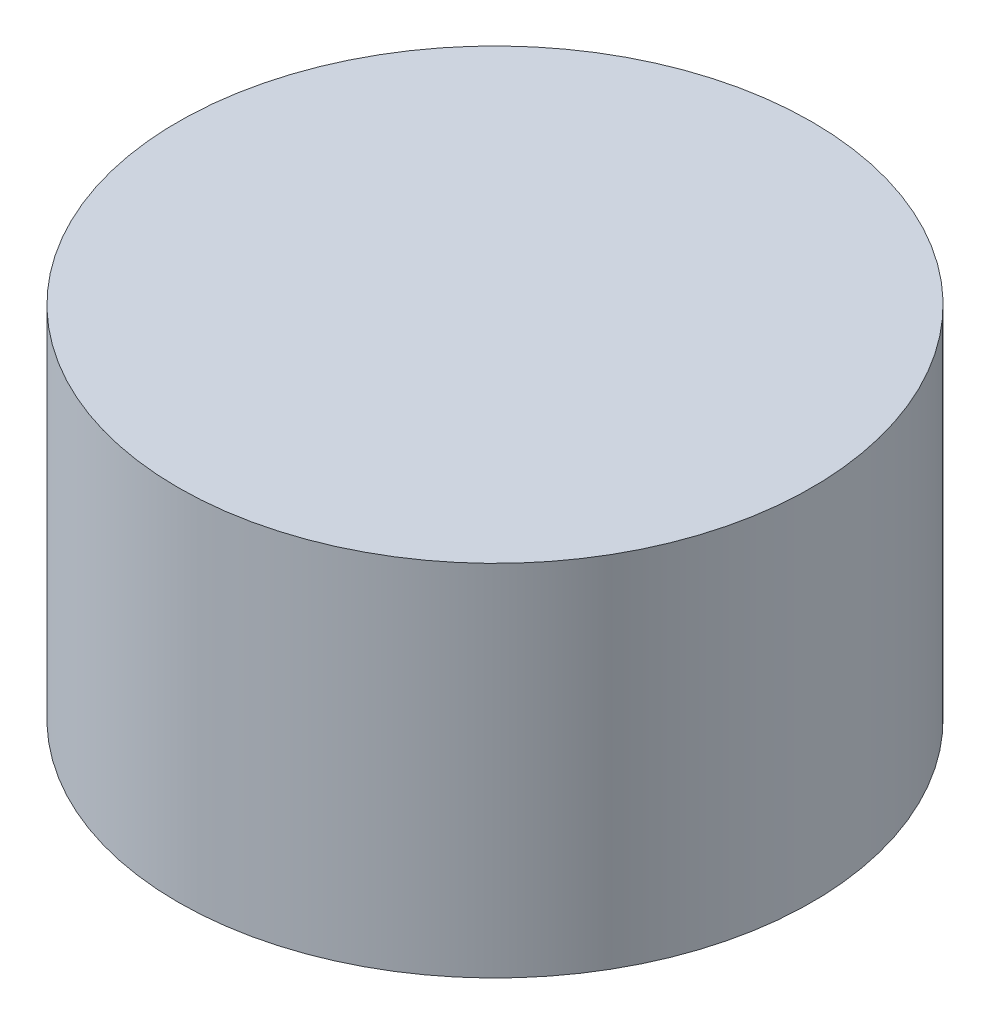
ISO-10303-21;
HEADER;
FILE_DESCRIPTION(('STEP AP214'),'2;1');
FILE_NAME('part.step','',(''),(''),'','','');
FILE_SCHEMA(('AUTOMOTIVE_DESIGN { 1 0 10303 214 1 1 1 1 }'));
ENDSEC;
DATA;
#1=APPLICATION_CONTEXT('core data for automotive mechanical design processes');
#2=APPLICATION_PROTOCOL_DEFINITION('international standard','automotive_design',2000,#1);
#3=PRODUCT_CONTEXT('',#1,'mechanical');
#4=PRODUCT('Part','Part','',(#3));
#5=PRODUCT_RELATED_PRODUCT_CATEGORY('part','',(#4));
#6=PRODUCT_DEFINITION_FORMATION('','',#4);
#7=PRODUCT_DEFINITION_CONTEXT('part definition',#1,'design');
#8=PRODUCT_DEFINITION('design','',#6,#7);
#9=PRODUCT_DEFINITION_SHAPE('','',#8);
#10=(LENGTH_UNIT() NAMED_UNIT(*) SI_UNIT(.MILLI.,.METRE.));
#11=(NAMED_UNIT(*) PLANE_ANGLE_UNIT() SI_UNIT($,.RADIAN.));
#12=(NAMED_UNIT(*) SI_UNIT($,.STERADIAN.) SOLID_ANGLE_UNIT());
#13=UNCERTAINTY_MEASURE_WITH_UNIT(LENGTH_MEASURE(1.E-05),#10,'distance_accuracy_value','');
#14=(GEOMETRIC_REPRESENTATION_CONTEXT(3) GLOBAL_UNCERTAINTY_ASSIGNED_CONTEXT((#13)) GLOBAL_UNIT_ASSIGNED_CONTEXT((#10,
#11,#12)) REPRESENTATION_CONTEXT('',''));
#15=CARTESIAN_POINT('',(0.,0.,0.));
#16=DIRECTION('',(0.,0.,1.));
#17=DIRECTION('',(1.,0.,0.));
#18=AXIS2_PLACEMENT_3D('',#15,#16,#17);
#19=CARTESIAN_POINT('',(0.,17.,0.));
#20=DIRECTION('',(0.,-1.,0.));
#21=DIRECTION('',(0.,0.,-1.));
#22=AXIS2_PLACEMENT_3D('',#19,#20,#21);
#23=CYLINDRICAL_SURFACE('',#22,15.);
#24=CARTESIAN_POINT('',(0.,17.,0.));
#25=DIRECTION('',(0.,1.,0.));
#26=DIRECTION('',(0.,0.,1.));
#27=AXIS2_PLACEMENT_3D('',#24,#25,#26);
#28=CIRCLE('',#27,15.);
#29=CARTESIAN_POINT('',(0.,17.,15.));
#30=VERTEX_POINT('',#29);
#31=EDGE_CURVE('E10',#30,#30,#28,.T.);
#32=ORIENTED_EDGE('',*,*,#31,.F.);
#33=EDGE_LOOP('',(#32));
#34=FACE_BOUND('',#33,.T.);
#35=CARTESIAN_POINT('',(0.,0.,0.));
#36=DIRECTION('',(0.,1.,0.));
#37=DIRECTION('',(0.,0.,1.));
#38=AXIS2_PLACEMENT_3D('',#35,#36,#37);
#39=CIRCLE('',#38,15.);
#40=CARTESIAN_POINT('',(0.,0.,15.));
#41=VERTEX_POINT('',#40);
#42=EDGE_CURVE('E38',#41,#41,#39,.T.);
#43=ORIENTED_EDGE('',*,*,#42,.T.);
#44=EDGE_LOOP('',(#43));
#45=FACE_BOUND('',#44,.T.);
#46=ADVANCED_FACE('F35',(#34,#45),#23,.T.);
#47=CARTESIAN_POINT('',(0.,17.,0.));
#48=DIRECTION('',(0.,1.,0.));
#49=DIRECTION('',(0.,0.,1.));
#50=AXIS2_PLACEMENT_3D('',#47,#48,#49);
#51=PLANE('',#50);
#52=ORIENTED_EDGE('',*,*,#31,.T.);
#53=EDGE_LOOP('',(#52));
#54=FACE_BOUND('',#53,.T.);
#55=ADVANCED_FACE('F50',(#54),#51,.T.);
#56=CARTESIAN_POINT('',(0.,0.,0.));
#57=DIRECTION('',(0.,1.,0.));
#58=DIRECTION('',(0.,0.,1.));
#59=AXIS2_PLACEMENT_3D('',#56,#57,#58);
#60=PLANE('',#59);
#61=ORIENTED_EDGE('',*,*,#42,.F.);
#62=EDGE_LOOP('',(#61));
#63=FACE_BOUND('',#62,.T.);
#64=ADVANCED_FACE('F48',(#63),#60,.F.);
#65=CLOSED_SHELL('',(#46,#55,#64));
#66=MANIFOLD_SOLID_BREP('B2',#65);
#67=ADVANCED_BREP_SHAPE_REPRESENTATION('',(#18,#66),#14);
#68=SHAPE_DEFINITION_REPRESENTATION(#9,#67);
ENDSEC;
END-ISO-10303-21;
